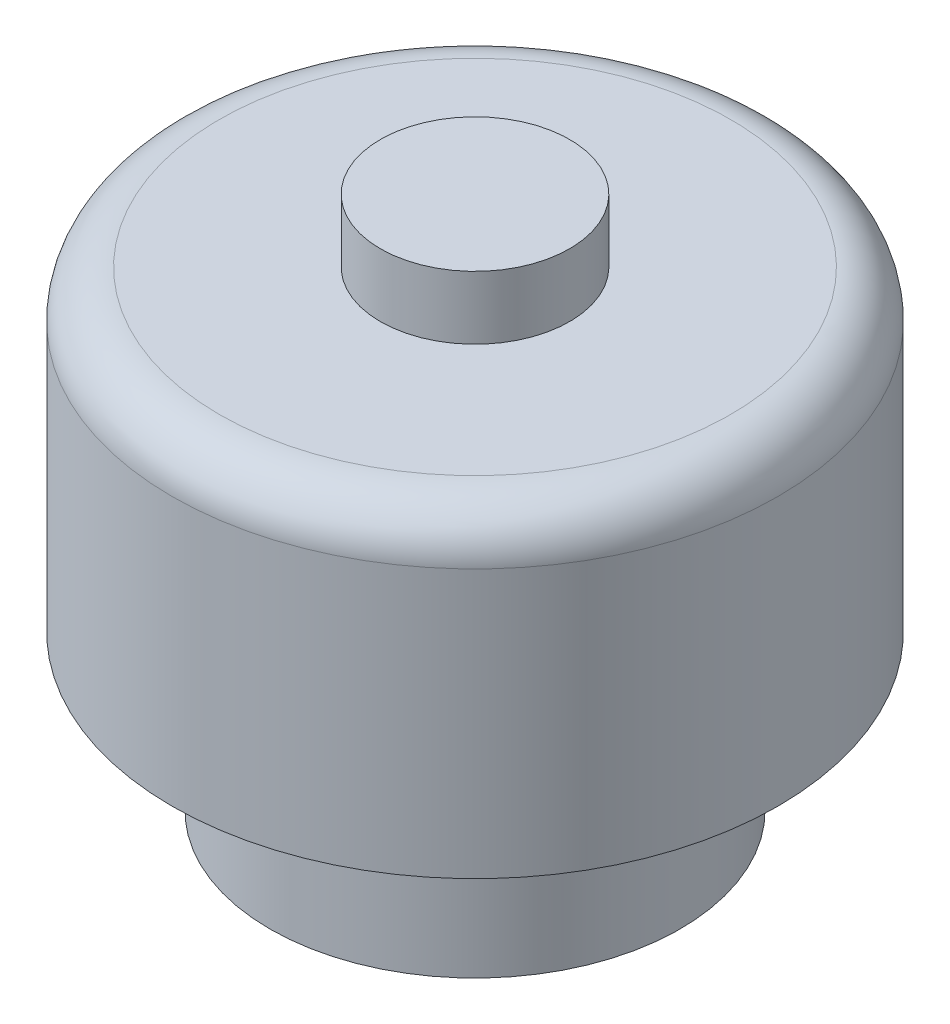
ISO-10303-21;
HEADER;
FILE_DESCRIPTION(('STEP AP214'),'2;1');
FILE_NAME('part.step','',(''),(''),'','','');
FILE_SCHEMA(('AUTOMOTIVE_DESIGN { 1 0 10303 214 1 1 1 1 }'));
ENDSEC;
DATA;
#1=APPLICATION_CONTEXT('core data for automotive mechanical design processes');
#2=APPLICATION_PROTOCOL_DEFINITION('international standard','automotive_design',2000,#1);
#3=PRODUCT_CONTEXT('',#1,'mechanical');
#4=PRODUCT('Part','Part','',(#3));
#5=PRODUCT_RELATED_PRODUCT_CATEGORY('part','',(#4));
#6=PRODUCT_DEFINITION_FORMATION('','',#4);
#7=PRODUCT_DEFINITION_CONTEXT('part definition',#1,'design');
#8=PRODUCT_DEFINITION('design','',#6,#7);
#9=PRODUCT_DEFINITION_SHAPE('','',#8);
#10=(LENGTH_UNIT() NAMED_UNIT(*) SI_UNIT(.MILLI.,.METRE.));
#11=(NAMED_UNIT(*) PLANE_ANGLE_UNIT() SI_UNIT($,.RADIAN.));
#12=(NAMED_UNIT(*) SI_UNIT($,.STERADIAN.) SOLID_ANGLE_UNIT());
#13=UNCERTAINTY_MEASURE_WITH_UNIT(LENGTH_MEASURE(1.E-05),#10,'distance_accuracy_value','');
#14=(GEOMETRIC_REPRESENTATION_CONTEXT(3) GLOBAL_UNCERTAINTY_ASSIGNED_CONTEXT((#13)) GLOBAL_UNIT_ASSIGNED_CONTEXT((#10,
#11,#12)) REPRESENTATION_CONTEXT('',''));
#15=CARTESIAN_POINT('',(0.,0.,0.));
#16=DIRECTION('',(0.,0.,1.));
#17=DIRECTION('',(1.,0.,0.));
#18=AXIS2_PLACEMENT_3D('',#15,#16,#17);
#19=CARTESIAN_POINT('',(0.,2.46,0.));
#20=DIRECTION('',(0.,-1.,0.));
#21=DIRECTION('',(0.,0.,-1.));
#22=AXIS2_PLACEMENT_3D('',#19,#20,#21);
#23=CYLINDRICAL_SURFACE('',#22,3.25);
#24=CARTESIAN_POINT('',(0.,2.46,0.));
#25=DIRECTION('',(0.,1.,0.));
#26=DIRECTION('',(0.,0.,1.));
#27=AXIS2_PLACEMENT_3D('',#24,#25,#26);
#28=CIRCLE('',#27,3.25);
#29=CARTESIAN_POINT('',(0.,2.46,3.25));
#30=VERTEX_POINT('',#29);
#31=EDGE_CURVE('E74',#30,#30,#28,.T.);
#32=ORIENTED_EDGE('',*,*,#31,.F.);
#33=EDGE_LOOP('',(#32));
#34=FACE_BOUND('',#33,.T.);
#35=CARTESIAN_POINT('',(0.,0.,0.));
#36=DIRECTION('',(0.,1.,0.));
#37=DIRECTION('',(0.,0.,1.));
#38=AXIS2_PLACEMENT_3D('',#35,#36,#37);
#39=CIRCLE('',#38,3.25);
#40=CARTESIAN_POINT('',(0.,0.,3.25));
#41=VERTEX_POINT('',#40);
#42=EDGE_CURVE('E79',#41,#41,#39,.T.);
#43=ORIENTED_EDGE('',*,*,#42,.T.);
#44=EDGE_LOOP('',(#43));
#45=FACE_BOUND('',#44,.T.);
#46=ADVANCED_FACE('F61',(#34,#45),#23,.T.);
#47=CARTESIAN_POINT('',(0.,0.,0.));
#48=DIRECTION('',(0.,1.,0.));
#49=DIRECTION('',(0.,0.,1.));
#50=AXIS2_PLACEMENT_3D('',#47,#48,#49);
#51=PLANE('',#50);
#52=CARTESIAN_POINT('',(0.,0.,0.));
#53=DIRECTION('',(0.,-1.,0.));
#54=DIRECTION('',(0.,0.,-1.));
#55=AXIS2_PLACEMENT_3D('',#52,#53,#54);
#56=CIRCLE('',#55,1.75);
#57=CARTESIAN_POINT('',(0.,0.,-1.75));
#58=VERTEX_POINT('',#57);
#59=EDGE_CURVE('E84',#58,#58,#56,.T.);
#60=ORIENTED_EDGE('',*,*,#59,.F.);
#61=EDGE_LOOP('',(#60));
#62=FACE_BOUND('',#61,.T.);
#63=ORIENTED_EDGE('',*,*,#42,.F.);
#64=EDGE_LOOP('',(#63));
#65=FACE_BOUND('',#64,.T.);
#66=ADVANCED_FACE('F130',(#62,#65),#51,.F.);
#67=CARTESIAN_POINT('',(0.,2.5,0.));
#68=DIRECTION('',(0.,-1.,0.));
#69=DIRECTION('',(0.,0.,-1.));
#70=AXIS2_PLACEMENT_3D('',#67,#68,#69);
#71=CYLINDRICAL_SURFACE('',#70,1.75);
#72=CARTESIAN_POINT('',(0.,2.46,0.));
#73=DIRECTION('',(0.,1.,0.));
#74=DIRECTION('',(0.,0.,1.));
#75=AXIS2_PLACEMENT_3D('',#72,#73,#74);
#76=CIRCLE('',#75,1.75);
#77=CARTESIAN_POINT('',(0.,2.46,1.75));
#78=VERTEX_POINT('',#77);
#79=EDGE_CURVE('E86',#78,#78,#76,.T.);
#80=ORIENTED_EDGE('',*,*,#79,.T.);
#81=EDGE_LOOP('',(#80));
#82=FACE_BOUND('',#81,.T.);
#83=ORIENTED_EDGE('',*,*,#59,.T.);
#84=EDGE_LOOP('',(#83));
#85=FACE_BOUND('',#84,.T.);
#86=ADVANCED_FACE('F126',(#82,#85),#71,.F.);
#87=CARTESIAN_POINT('',(0.,2.46,0.));
#88=DIRECTION('',(0.,1.,0.));
#89=DIRECTION('',(0.,0.,1.));
#90=AXIS2_PLACEMENT_3D('',#87,#88,#89);
#91=PLANE('',#90);
#92=ORIENTED_EDGE('',*,*,#31,.T.);
#93=EDGE_LOOP('',(#92));
#94=FACE_BOUND('',#93,.T.);
#95=CARTESIAN_POINT('',(0.,2.46,0.));
#96=DIRECTION('',(0.,1.,0.));
#97=DIRECTION('',(0.,0.,1.));
#98=AXIS2_PLACEMENT_3D('',#95,#96,#97);
#99=CIRCLE('',#98,4.8);
#100=CARTESIAN_POINT('',(0.,2.46,4.8));
#101=VERTEX_POINT('',#100);
#102=EDGE_CURVE('E90',#101,#101,#99,.T.);
#103=ORIENTED_EDGE('',*,*,#102,.F.);
#104=EDGE_LOOP('',(#103));
#105=FACE_BOUND('',#104,.T.);
#106=ADVANCED_FACE('F117',(#94,#105),#91,.F.);
#107=CARTESIAN_POINT('',(0.,7.46,0.));
#108=DIRECTION('',(0.,1.,0.));
#109=DIRECTION('',(0.,0.,1.));
#110=AXIS2_PLACEMENT_3D('',#107,#108,#109);
#111=PLANE('',#110);
#112=CARTESIAN_POINT('',(0.,7.46,0.));
#113=DIRECTION('',(0.,1.,0.));
#114=DIRECTION('',(0.,0.,1.));
#115=AXIS2_PLACEMENT_3D('',#112,#113,#114);
#116=CIRCLE('',#115,1.5);
#117=CARTESIAN_POINT('',(0.,7.46,1.5));
#118=VERTEX_POINT('',#117);
#119=EDGE_CURVE('E98',#118,#118,#116,.T.);
#120=ORIENTED_EDGE('',*,*,#119,.F.);
#121=EDGE_LOOP('',(#120));
#122=FACE_BOUND('',#121,.T.);
#123=CARTESIAN_POINT('',(0.,7.46,0.));
#124=DIRECTION('',(0.,1.,0.));
#125=DIRECTION('',(0.,0.,1.));
#126=AXIS2_PLACEMENT_3D('',#123,#124,#125);
#127=CIRCLE('',#126,4.05);
#128=CARTESIAN_POINT('',(0.,7.46,4.05));
#129=VERTEX_POINT('',#128);
#130=EDGE_CURVE('E69',#129,#129,#127,.T.);
#131=ORIENTED_EDGE('',*,*,#130,.T.);
#132=EDGE_LOOP('',(#131));
#133=FACE_BOUND('',#132,.T.);
#134=ADVANCED_FACE('F114',(#122,#133),#111,.T.);
#135=CARTESIAN_POINT('',(0.,7.46,0.));
#136=DIRECTION('',(0.,-1.,0.));
#137=DIRECTION('',(0.,0.,-1.));
#138=AXIS2_PLACEMENT_3D('',#135,#136,#137);
#139=CYLINDRICAL_SURFACE('',#138,4.8);
#140=CARTESIAN_POINT('',(0.,6.71,0.));
#141=DIRECTION('',(0.,1.,0.));
#142=DIRECTION('',(0.,0.,1.));
#143=AXIS2_PLACEMENT_3D('',#140,#141,#142);
#144=CIRCLE('',#143,4.8);
#145=CARTESIAN_POINT('',(0.,6.71,4.8));
#146=VERTEX_POINT('',#145);
#147=EDGE_CURVE('E11',#146,#146,#144,.F.);
#148=ORIENTED_EDGE('',*,*,#147,.T.);
#149=EDGE_LOOP('',(#148));
#150=FACE_BOUND('',#149,.T.);
#151=ORIENTED_EDGE('',*,*,#102,.T.);
#152=EDGE_LOOP('',(#151));
#153=FACE_BOUND('',#152,.T.);
#154=ADVANCED_FACE('F116',(#150,#153),#139,.T.);
#155=ORIENTED_EDGE('',*,*,#79,.F.);
#156=EDGE_LOOP('',(#155));
#157=FACE_BOUND('',#156,.T.);
#158=ADVANCED_FACE('F123',(#157),#91,.F.);
#159=CARTESIAN_POINT('',(0.,6.71,0.));
#160=DIRECTION('',(0.,1.,0.));
#161=DIRECTION('',(0.,0.,1.));
#162=AXIS2_PLACEMENT_3D('',#159,#160,#161);
#163=TOROIDAL_SURFACE('',#162,4.05,0.75);
#164=ORIENTED_EDGE('',*,*,#147,.F.);
#165=EDGE_LOOP('',(#164));
#166=FACE_BOUND('',#165,.T.);
#167=ORIENTED_EDGE('',*,*,#130,.F.);
#168=EDGE_LOOP('',(#167));
#169=FACE_BOUND('',#168,.T.);
#170=ADVANCED_FACE('F63',(#166,#169),#163,.T.);
#171=CARTESIAN_POINT('',(0.,8.46,0.));
#172=DIRECTION('',(0.,-1.,0.));
#173=DIRECTION('',(0.,0.,-1.));
#174=AXIS2_PLACEMENT_3D('',#171,#172,#173);
#175=CYLINDRICAL_SURFACE('',#174,1.5);
#176=CARTESIAN_POINT('',(0.,8.46,0.));
#177=DIRECTION('',(0.,1.,0.));
#178=DIRECTION('',(0.,0.,1.));
#179=AXIS2_PLACEMENT_3D('',#176,#177,#178);
#180=CIRCLE('',#179,1.5);
#181=CARTESIAN_POINT('',(0.,8.46,1.5));
#182=VERTEX_POINT('',#181);
#183=EDGE_CURVE('E97',#182,#182,#180,.T.);
#184=ORIENTED_EDGE('',*,*,#183,.F.);
#185=EDGE_LOOP('',(#184));
#186=FACE_BOUND('',#185,.T.);
#187=ORIENTED_EDGE('',*,*,#119,.T.);
#188=EDGE_LOOP('',(#187));
#189=FACE_BOUND('',#188,.T.);
#190=ADVANCED_FACE('F108',(#186,#189),#175,.T.);
#191=CARTESIAN_POINT('',(0.,8.46,0.));
#192=DIRECTION('',(0.,1.,0.));
#193=DIRECTION('',(0.,0.,1.));
#194=AXIS2_PLACEMENT_3D('',#191,#192,#193);
#195=PLANE('',#194);
#196=ORIENTED_EDGE('',*,*,#183,.T.);
#197=EDGE_LOOP('',(#196));
#198=FACE_BOUND('',#197,.T.);
#199=ADVANCED_FACE('F106',(#198),#195,.T.);
#200=CLOSED_SHELL('',(#46,#66,#86,#106,#134,#154,#158,#170,#190,#199));
#201=MANIFOLD_SOLID_BREP('B2',#200);
#202=ADVANCED_BREP_SHAPE_REPRESENTATION('',(#18,#201),#14);
#203=SHAPE_DEFINITION_REPRESENTATION(#9,#202);
ENDSEC;
END-ISO-10303-21;
